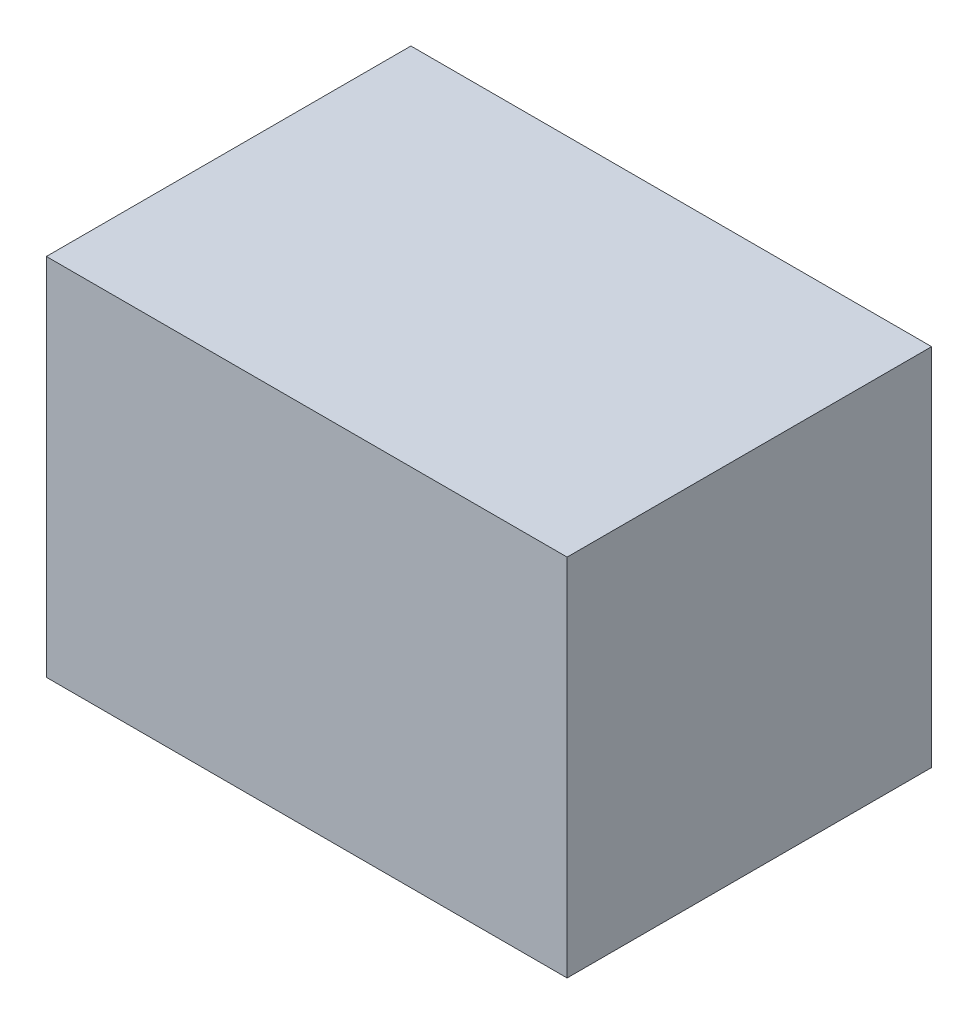
ISO-10303-21;
HEADER;
FILE_DESCRIPTION(('STEP AP214'),'2;1');
FILE_NAME('part.step','',(''),(''),'','','');
FILE_SCHEMA(('AUTOMOTIVE_DESIGN { 1 0 10303 214 1 1 1 1 }'));
ENDSEC;
DATA;
#1=APPLICATION_CONTEXT('core data for automotive mechanical design processes');
#2=APPLICATION_PROTOCOL_DEFINITION('international standard','automotive_design',2000,#1);
#3=PRODUCT_CONTEXT('',#1,'mechanical');
#4=PRODUCT('Part','Part','',(#3));
#5=PRODUCT_RELATED_PRODUCT_CATEGORY('part','',(#4));
#6=PRODUCT_DEFINITION_FORMATION('','',#4);
#7=PRODUCT_DEFINITION_CONTEXT('part definition',#1,'design');
#8=PRODUCT_DEFINITION('design','',#6,#7);
#9=PRODUCT_DEFINITION_SHAPE('','',#8);
#10=(LENGTH_UNIT() NAMED_UNIT(*) SI_UNIT(.MILLI.,.METRE.));
#11=(NAMED_UNIT(*) PLANE_ANGLE_UNIT() SI_UNIT($,.RADIAN.));
#12=(NAMED_UNIT(*) SI_UNIT($,.STERADIAN.) SOLID_ANGLE_UNIT());
#13=UNCERTAINTY_MEASURE_WITH_UNIT(LENGTH_MEASURE(1.E-05),#10,'distance_accuracy_value','');
#14=(GEOMETRIC_REPRESENTATION_CONTEXT(3) GLOBAL_UNCERTAINTY_ASSIGNED_CONTEXT((#13)) GLOBAL_UNIT_ASSIGNED_CONTEXT((#10,
#11,#12)) REPRESENTATION_CONTEXT('',''));
#15=CARTESIAN_POINT('',(0.,0.,0.));
#16=DIRECTION('',(0.,0.,1.));
#17=DIRECTION('',(1.,0.,0.));
#18=AXIS2_PLACEMENT_3D('',#15,#16,#17);
#19=CARTESIAN_POINT('',(-12.7,0.,0.));
#20=DIRECTION('',(0.,1.,0.));
#21=DIRECTION('',(1.,0.,0.));
#22=AXIS2_PLACEMENT_3D('',#19,#20,#21);
#23=PLANE('',#22);
#24=DIRECTION('',(0.,0.,1.));
#25=VECTOR('',#24,1.);
#26=CARTESIAN_POINT('',(2.29,0.,0.749999999999982));
#27=LINE('',#26,#25);
#28=CARTESIAN_POINT('',(2.29,0.,0.749999999999982));
#29=VERTEX_POINT('',#28);
#30=CARTESIAN_POINT('',(2.29,0.,1.1));
#31=VERTEX_POINT('',#30);
#32=EDGE_CURVE('E21',#29,#31,#27,.T.);
#33=ORIENTED_EDGE('',*,*,#32,.T.);
#34=DIRECTION('',(1.,0.,0.));
#35=VECTOR('',#34,1.);
#36=CARTESIAN_POINT('',(2.29,0.,1.1));
#37=LINE('',#36,#35);
#38=CARTESIAN_POINT('',(2.79,0.,1.1));
#39=VERTEX_POINT('',#38);
#40=EDGE_CURVE('E28',#31,#39,#37,.T.);
#41=ORIENTED_EDGE('',*,*,#40,.T.);
#42=DIRECTION('',(0.,0.,1.));
#43=VECTOR('',#42,1.);
#44=CARTESIAN_POINT('',(2.79,0.,0.749999999999982));
#45=LINE('',#44,#43);
#46=CARTESIAN_POINT('',(2.79,0.,0.749999999999982));
#47=VERTEX_POINT('',#46);
#48=EDGE_CURVE('E70',#47,#39,#45,.T.);
#49=ORIENTED_EDGE('',*,*,#48,.F.);
#50=DIRECTION('',(1.,0.,0.));
#51=VECTOR('',#50,1.);
#52=CARTESIAN_POINT('',(2.29,0.,0.749999999999982));
#53=LINE('',#52,#51);
#54=EDGE_CURVE('E66',#29,#47,#53,.T.);
#55=ORIENTED_EDGE('',*,*,#54,.F.);
#56=EDGE_LOOP('',(#33,#41,#49,#55));
#57=FACE_BOUND('',#56,.T.);
#58=ADVANCED_FACE('F17',(#57),#23,.T.);
#59=CARTESIAN_POINT('',(-12.7,-0.35,0.));
#60=DIRECTION('',(0.,1.,0.));
#61=DIRECTION('',(1.,0.,0.));
#62=AXIS2_PLACEMENT_3D('',#59,#60,#61);
#63=PLANE('',#62);
#64=DIRECTION('',(0.,0.,1.));
#65=VECTOR('',#64,1.);
#66=CARTESIAN_POINT('',(2.29,-0.35,0.749999999999982));
#67=LINE('',#66,#65);
#68=CARTESIAN_POINT('',(2.29,-0.35,0.749999999999982));
#69=VERTEX_POINT('',#68);
#70=CARTESIAN_POINT('',(2.29,-0.35,1.1));
#71=VERTEX_POINT('',#70);
#72=EDGE_CURVE('E88',#69,#71,#67,.T.);
#73=ORIENTED_EDGE('',*,*,#72,.F.);
#74=DIRECTION('',(1.,0.,0.));
#75=VECTOR('',#74,1.);
#76=CARTESIAN_POINT('',(2.29,-0.35,0.749999999999982));
#77=LINE('',#76,#75);
#78=CARTESIAN_POINT('',(2.79,-0.35,0.749999999999982));
#79=VERTEX_POINT('',#78);
#80=EDGE_CURVE('E83',#69,#79,#77,.T.);
#81=ORIENTED_EDGE('',*,*,#80,.T.);
#82=DIRECTION('',(0.,0.,1.));
#83=VECTOR('',#82,1.);
#84=CARTESIAN_POINT('',(2.79,-0.35,0.749999999999982));
#85=LINE('',#84,#83);
#86=CARTESIAN_POINT('',(2.79,-0.35,1.1));
#87=VERTEX_POINT('',#86);
#88=EDGE_CURVE('E219',#79,#87,#85,.T.);
#89=ORIENTED_EDGE('',*,*,#88,.T.);
#90=DIRECTION('',(1.,0.,0.));
#91=VECTOR('',#90,1.);
#92=CARTESIAN_POINT('',(2.29,-0.35,1.1));
#93=LINE('',#92,#91);
#94=EDGE_CURVE('E11',#71,#87,#93,.T.);
#95=ORIENTED_EDGE('',*,*,#94,.F.);
#96=EDGE_LOOP('',(#73,#81,#89,#95));
#97=FACE_BOUND('',#96,.T.);
#98=ADVANCED_FACE('F19',(#97),#63,.F.);
#99=CARTESIAN_POINT('',(2.29,-0.35,1.1));
#100=DIRECTION('',(0.,0.,1.));
#101=DIRECTION('',(1.,0.,0.));
#102=AXIS2_PLACEMENT_3D('',#99,#100,#101);
#103=PLANE('',#102);
#104=ORIENTED_EDGE('',*,*,#40,.F.);
#105=DIRECTION('',(0.,1.,0.));
#106=VECTOR('',#105,1.);
#107=CARTESIAN_POINT('',(2.29,-0.35,1.1));
#108=LINE('',#107,#106);
#109=EDGE_CURVE('E76',#71,#31,#108,.T.);
#110=ORIENTED_EDGE('',*,*,#109,.F.);
#111=ORIENTED_EDGE('',*,*,#94,.T.);
#112=DIRECTION('',(0.,1.,0.));
#113=VECTOR('',#112,1.);
#114=CARTESIAN_POINT('',(2.79,-0.35,1.1));
#115=LINE('',#114,#113);
#116=EDGE_CURVE('E231',#87,#39,#115,.T.);
#117=ORIENTED_EDGE('',*,*,#116,.T.);
#118=EDGE_LOOP('',(#104,#110,#111,#117));
#119=FACE_BOUND('',#118,.T.);
#120=ADVANCED_FACE('F130',(#119),#103,.T.);
#121=CARTESIAN_POINT('',(2.79,-0.35,0.749999999999982));
#122=DIRECTION('',(-1.,0.,0.));
#123=DIRECTION('',(0.,0.,1.));
#124=AXIS2_PLACEMENT_3D('',#121,#122,#123);
#125=PLANE('',#124);
#126=ORIENTED_EDGE('',*,*,#48,.T.);
#127=ORIENTED_EDGE('',*,*,#116,.F.);
#128=ORIENTED_EDGE('',*,*,#88,.F.);
#129=DIRECTION('',(0.,1.,0.));
#130=VECTOR('',#129,1.);
#131=CARTESIAN_POINT('',(2.79,-0.35,0.749999999999982));
#132=LINE('',#131,#130);
#133=EDGE_CURVE('E75',#79,#47,#132,.T.);
#134=ORIENTED_EDGE('',*,*,#133,.T.);
#135=EDGE_LOOP('',(#126,#127,#128,#134));
#136=FACE_BOUND('',#135,.T.);
#137=ADVANCED_FACE('F119',(#136),#125,.F.);
#138=CARTESIAN_POINT('',(2.29,-0.35,0.749999999999982));
#139=DIRECTION('',(0.,0.,1.));
#140=DIRECTION('',(1.,0.,0.));
#141=AXIS2_PLACEMENT_3D('',#138,#139,#140);
#142=PLANE('',#141);
#143=ORIENTED_EDGE('',*,*,#54,.T.);
#144=ORIENTED_EDGE('',*,*,#133,.F.);
#145=ORIENTED_EDGE('',*,*,#80,.F.);
#146=DIRECTION('',(0.,1.,0.));
#147=VECTOR('',#146,1.);
#148=CARTESIAN_POINT('',(2.29,-0.35,0.749999999999982));
#149=LINE('',#148,#147);
#150=EDGE_CURVE('E80',#69,#29,#149,.T.);
#151=ORIENTED_EDGE('',*,*,#150,.T.);
#152=EDGE_LOOP('',(#143,#144,#145,#151));
#153=FACE_BOUND('',#152,.T.);
#154=ADVANCED_FACE('F81',(#153),#142,.F.);
#155=CARTESIAN_POINT('',(2.29,-0.35,0.749999999999982));
#156=DIRECTION('',(-1.,0.,0.));
#157=DIRECTION('',(0.,0.,1.));
#158=AXIS2_PLACEMENT_3D('',#155,#156,#157);
#159=PLANE('',#158);
#160=ORIENTED_EDGE('',*,*,#32,.F.);
#161=ORIENTED_EDGE('',*,*,#150,.F.);
#162=ORIENTED_EDGE('',*,*,#72,.T.);
#163=ORIENTED_EDGE('',*,*,#109,.T.);
#164=EDGE_LOOP('',(#160,#161,#162,#163));
#165=FACE_BOUND('',#164,.T.);
#166=ADVANCED_FACE('F91',(#165),#159,.T.);
#167=CLOSED_SHELL('',(#58,#98,#120,#137,#154,#166));
#168=MANIFOLD_SOLID_BREP('B1',#167);
#169=ADVANCED_BREP_SHAPE_REPRESENTATION('',(#18,#168),#14);
#170=SHAPE_DEFINITION_REPRESENTATION(#9,#169);
ENDSEC;
END-ISO-10303-21;
